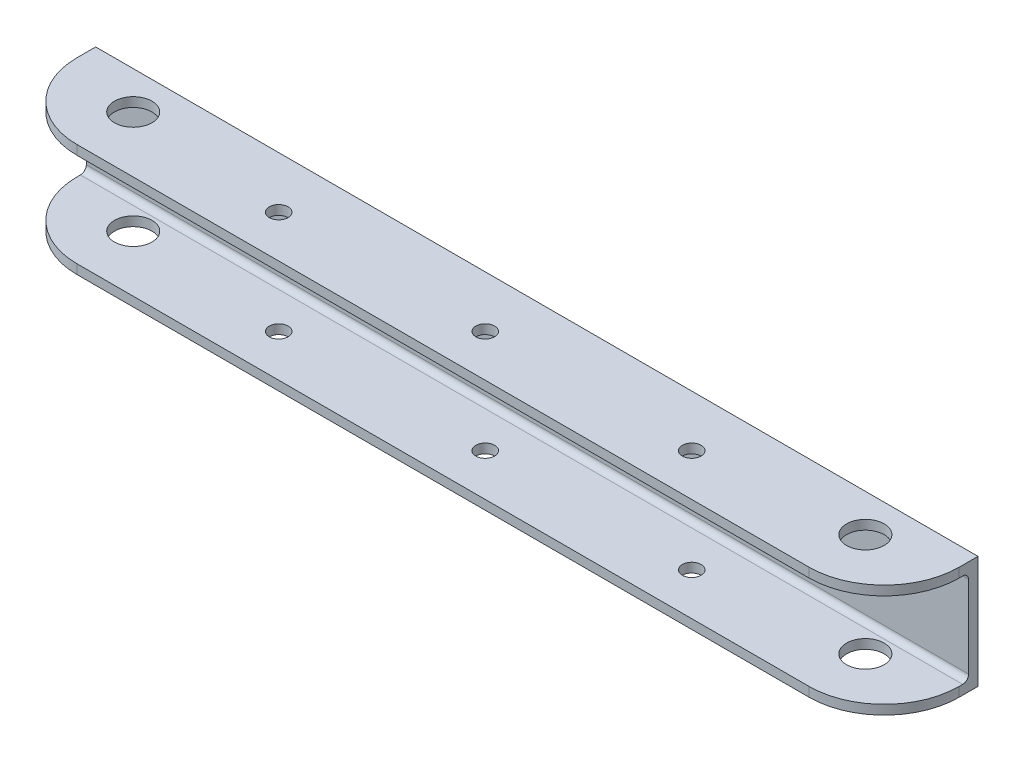
ISO-10303-21;
HEADER;
FILE_DESCRIPTION(('STEP AP214'),'2;1');
FILE_NAME('part.step','',(''),(''),'','','');
FILE_SCHEMA(('AUTOMOTIVE_DESIGN { 1 0 10303 214 1 1 1 1 }'));
ENDSEC;
DATA;
#1=APPLICATION_CONTEXT('core data for automotive mechanical design processes');
#2=APPLICATION_PROTOCOL_DEFINITION('international standard','automotive_design',2000,#1);
#3=PRODUCT_CONTEXT('',#1,'mechanical');
#4=PRODUCT('Part','Part','',(#3));
#5=PRODUCT_RELATED_PRODUCT_CATEGORY('part','',(#4));
#6=PRODUCT_DEFINITION_FORMATION('','',#4);
#7=PRODUCT_DEFINITION_CONTEXT('part definition',#1,'design');
#8=PRODUCT_DEFINITION('design','',#6,#7);
#9=PRODUCT_DEFINITION_SHAPE('','',#8);
#10=(LENGTH_UNIT() NAMED_UNIT(*) SI_UNIT(.MILLI.,.METRE.));
#11=(NAMED_UNIT(*) PLANE_ANGLE_UNIT() SI_UNIT($,.RADIAN.));
#12=(NAMED_UNIT(*) SI_UNIT($,.STERADIAN.) SOLID_ANGLE_UNIT());
#13=UNCERTAINTY_MEASURE_WITH_UNIT(LENGTH_MEASURE(1.E-05),#10,'distance_accuracy_value','');
#14=(GEOMETRIC_REPRESENTATION_CONTEXT(3) GLOBAL_UNCERTAINTY_ASSIGNED_CONTEXT((#13)) GLOBAL_UNIT_ASSIGNED_CONTEXT((#10,
#11,#12)) REPRESENTATION_CONTEXT('',''));
#15=CARTESIAN_POINT('',(0.,0.,0.));
#16=DIRECTION('',(0.,0.,1.));
#17=DIRECTION('',(1.,0.,0.));
#18=AXIS2_PLACEMENT_3D('',#15,#16,#17);
#19=CARTESIAN_POINT('',(0.,0.,31.75));
#20=DIRECTION('',(0.,0.,1.));
#21=DIRECTION('',(1.,0.,0.));
#22=AXIS2_PLACEMENT_3D('',#19,#20,#21);
#23=PLANE('',#22);
#24=DIRECTION('',(-1.,0.,0.));
#25=VECTOR('',#24,1.);
#26=CARTESIAN_POINT('',(0.,0.,31.75));
#27=LINE('',#26,#25);
#28=CARTESIAN_POINT('',(-313.675887252,0.,31.75));
#29=VERTEX_POINT('',#28);
#30=CARTESIAN_POINT('',(-561.325887252,0.,31.75));
#31=VERTEX_POINT('',#30);
#32=EDGE_CURVE('E190',#29,#31,#27,.T.);
#33=ORIENTED_EDGE('',*,*,#32,.F.);
#34=DIRECTION('',(0.,1.,0.));
#35=VECTOR('',#34,1.);
#36=CARTESIAN_POINT('',(-313.675887252,3.17499999999967,31.75));
#37=LINE('',#36,#35);
#38=CARTESIAN_POINT('',(-313.675887252,3.17499999999967,31.75));
#39=VERTEX_POINT('',#38);
#40=EDGE_CURVE('E236',#29,#39,#37,.T.);
#41=ORIENTED_EDGE('',*,*,#40,.T.);
#42=DIRECTION('',(-1.,0.,0.));
#43=VECTOR('',#42,1.);
#44=CARTESIAN_POINT('',(-288.275887252,3.17499999999967,31.75));
#45=LINE('',#44,#43);
#46=CARTESIAN_POINT('',(-561.325887252,3.17499999999967,31.75));
#47=VERTEX_POINT('',#46);
#48=EDGE_CURVE('E173',#39,#47,#45,.T.);
#49=ORIENTED_EDGE('',*,*,#48,.T.);
#50=DIRECTION('',(0.,1.,0.));
#51=VECTOR('',#50,1.);
#52=CARTESIAN_POINT('',(-561.325887252,4.90706239642227E-12,31.75));
#53=LINE('',#52,#51);
#54=EDGE_CURVE('E233',#47,#31,#53,.F.);
#55=ORIENTED_EDGE('',*,*,#54,.T.);
#56=EDGE_LOOP('',(#33,#41,#49,#55));
#57=FACE_BOUND('',#56,.T.);
#58=ADVANCED_FACE('F46',(#57),#23,.T.);
#59=CARTESIAN_POINT('',(-586.725887252,5.12910700134741E-12,31.75));
#60=DIRECTION('',(-1.,0.,0.));
#61=DIRECTION('',(0.,-1.,0.));
#62=AXIS2_PLACEMENT_3D('',#59,#60,#61);
#63=PLANE('',#62);
#64=DIRECTION('',(0.,0.,-1.));
#65=VECTOR('',#64,1.);
#66=CARTESIAN_POINT('',(-586.725887252,0.,31.75));
#67=LINE('',#66,#65);
#68=CARTESIAN_POINT('',(-586.725887252,0.,6.35));
#69=VERTEX_POINT('',#68);
#70=CARTESIAN_POINT('',(-586.725887252,0.,0.));
#71=VERTEX_POINT('',#70);
#72=EDGE_CURVE('E148',#69,#71,#67,.T.);
#73=ORIENTED_EDGE('',*,*,#72,.F.);
#74=DIRECTION('',(0.,1.,0.));
#75=VECTOR('',#74,1.);
#76=CARTESIAN_POINT('',(-586.725887252,5.12910700134741E-12,6.35));
#77=LINE('',#76,#75);
#78=CARTESIAN_POINT('',(-586.725887252,3.17499999999966,6.35000000000001));
#79=VERTEX_POINT('',#78);
#80=EDGE_CURVE('E254',#69,#79,#77,.T.);
#81=ORIENTED_EDGE('',*,*,#80,.T.);
#82=DIRECTION('',(0.,0.,1.));
#83=VECTOR('',#82,1.);
#84=CARTESIAN_POINT('',(-586.725887252,3.17499999999967,31.75));
#85=LINE('',#84,#83);
#86=CARTESIAN_POINT('',(-586.725887252,3.17499999999966,5.17500000000001));
#87=VERTEX_POINT('',#86);
#88=EDGE_CURVE('E330',#87,#79,#85,.T.);
#89=ORIENTED_EDGE('',*,*,#88,.F.);
#90=CARTESIAN_POINT('',(-586.725887252,5.17499999999966,5.175));
#91=DIRECTION('',(-1.,0.,0.));
#92=DIRECTION('',(0.,-1.,0.));
#93=AXIS2_PLACEMENT_3D('',#90,#91,#92);
#94=CIRCLE('',#93,2.);
#95=CARTESIAN_POINT('',(-586.725887252,5.17499999999966,3.175));
#96=VERTEX_POINT('',#95);
#97=EDGE_CURVE('E286',#87,#96,#94,.F.);
#98=ORIENTED_EDGE('',*,*,#97,.T.);
#99=DIRECTION('',(0.,-1.,0.));
#100=VECTOR('',#99,1.);
#101=CARTESIAN_POINT('',(-586.725887252,34.9249999999615,3.175));
#102=LINE('',#101,#100);
#103=CARTESIAN_POINT('',(-586.725887252,32.9249999999615,3.175));
#104=VERTEX_POINT('',#103);
#105=EDGE_CURVE('E325',#104,#96,#102,.T.);
#106=ORIENTED_EDGE('',*,*,#105,.F.);
#107=CARTESIAN_POINT('',(-586.725887252,32.9249999999615,5.175));
#108=DIRECTION('',(-1.,0.,0.));
#109=DIRECTION('',(0.,-1.,0.));
#110=AXIS2_PLACEMENT_3D('',#107,#108,#109);
#111=CIRCLE('',#110,2.);
#112=CARTESIAN_POINT('',(-586.725887252,34.9249999999615,5.175));
#113=VERTEX_POINT('',#112);
#114=EDGE_CURVE('E55',#104,#113,#111,.F.);
#115=ORIENTED_EDGE('',*,*,#114,.T.);
#116=DIRECTION('',(0.,0.,-1.));
#117=VECTOR('',#116,1.);
#118=CARTESIAN_POINT('',(-586.725887252,34.9249999999615,31.75));
#119=LINE('',#118,#117);
#120=CARTESIAN_POINT('',(-586.725887252,34.9249999999615,6.35));
#121=VERTEX_POINT('',#120);
#122=EDGE_CURVE('E323',#121,#113,#119,.T.);
#123=ORIENTED_EDGE('',*,*,#122,.F.);
#124=DIRECTION('',(0.,1.,0.));
#125=VECTOR('',#124,1.);
#126=CARTESIAN_POINT('',(-586.725887252,5.12910700134741E-12,6.35));
#127=LINE('',#126,#125);
#128=CARTESIAN_POINT('',(-586.725887252,38.0999999999806,6.35));
#129=VERTEX_POINT('',#128);
#130=EDGE_CURVE('E251',#121,#129,#127,.T.);
#131=ORIENTED_EDGE('',*,*,#130,.T.);
#132=DIRECTION('',(0.,0.,-1.));
#133=VECTOR('',#132,1.);
#134=CARTESIAN_POINT('',(-586.725887252,38.0999999999806,31.75));
#135=LINE('',#134,#133);
#136=CARTESIAN_POINT('',(-586.725887252,38.0999999999806,0.));
#137=VERTEX_POINT('',#136);
#138=EDGE_CURVE('E168',#129,#137,#135,.T.);
#139=ORIENTED_EDGE('',*,*,#138,.T.);
#140=DIRECTION('',(0.,1.,0.));
#141=VECTOR('',#140,1.);
#142=CARTESIAN_POINT('',(-586.725887252,5.12910700134741E-12,0.));
#143=LINE('',#142,#141);
#144=EDGE_CURVE('E164',#71,#137,#143,.T.);
#145=ORIENTED_EDGE('',*,*,#144,.F.);
#146=EDGE_LOOP('',(#73,#81,#89,#98,#106,#115,#123,#131,#139,#145));
#147=FACE_BOUND('',#146,.T.);
#148=ADVANCED_FACE('F165',(#147),#63,.T.);
#149=CARTESIAN_POINT('',(0.,0.,31.75));
#150=DIRECTION('',(0.,-1.,0.));
#151=DIRECTION('',(0.,0.,-1.));
#152=AXIS2_PLACEMENT_3D('',#149,#150,#151);
#153=PLANE('',#152);
#154=CARTESIAN_POINT('',(-507.350887252,0.,17.4625));
#155=DIRECTION('',(0.,-1.,0.));
#156=DIRECTION('',(0.,0.,-1.));
#157=AXIS2_PLACEMENT_3D('',#154,#155,#156);
#158=CIRCLE('',#157,3.17500000000008);
#159=CARTESIAN_POINT('',(-507.350887252,0.,14.2874999999999));
#160=VERTEX_POINT('',#159);
#161=EDGE_CURVE('E388',#160,#160,#158,.T.);
#162=ORIENTED_EDGE('',*,*,#161,.F.);
#163=EDGE_LOOP('',(#162));
#164=FACE_BOUND('',#163,.T.);
#165=CARTESIAN_POINT('',(-437.500887252,0.,17.4625));
#166=DIRECTION('',(0.,-1.,0.));
#167=DIRECTION('',(0.,0.,-1.));
#168=AXIS2_PLACEMENT_3D('',#165,#166,#167);
#169=CIRCLE('',#168,3.17499999999997);
#170=CARTESIAN_POINT('',(-437.500887252,0.,14.2875));
#171=VERTEX_POINT('',#170);
#172=EDGE_CURVE('E380',#171,#171,#169,.T.);
#173=ORIENTED_EDGE('',*,*,#172,.F.);
#174=EDGE_LOOP('',(#173));
#175=FACE_BOUND('',#174,.T.);
#176=CARTESIAN_POINT('',(-367.650887252,0.,17.4625));
#177=DIRECTION('',(0.,-1.,0.));
#178=DIRECTION('',(0.,0.,-1.));
#179=AXIS2_PLACEMENT_3D('',#176,#177,#178);
#180=CIRCLE('',#179,3.17499999999997);
#181=CARTESIAN_POINT('',(-367.650887252,0.,14.2875));
#182=VERTEX_POINT('',#181);
#183=EDGE_CURVE('E373',#182,#182,#180,.T.);
#184=ORIENTED_EDGE('',*,*,#183,.F.);
#185=EDGE_LOOP('',(#184));
#186=FACE_BOUND('',#185,.T.);
#187=CARTESIAN_POINT('',(-561.325887251953,0.,12.700000000014));
#188=DIRECTION('',(0.,-1.,0.));
#189=DIRECTION('',(0.,0.,-1.));
#190=AXIS2_PLACEMENT_3D('',#187,#188,#189);
#191=CIRCLE('',#190,6.3499999999972);
#192=CARTESIAN_POINT('',(-561.325887251953,0.,6.35000000001679));
#193=VERTEX_POINT('',#192);
#194=EDGE_CURVE('E360',#193,#193,#191,.T.);
#195=ORIENTED_EDGE('',*,*,#194,.F.);
#196=EDGE_LOOP('',(#195));
#197=FACE_BOUND('',#196,.T.);
#198=CARTESIAN_POINT('',(-313.675887252047,0.,12.700000000014));
#199=DIRECTION('',(0.,-1.,0.));
#200=DIRECTION('',(0.,0.,-1.));
#201=AXIS2_PLACEMENT_3D('',#198,#199,#200);
#202=CIRCLE('',#201,6.35);
#203=CARTESIAN_POINT('',(-313.675887252047,0.,6.35000000001399));
#204=VERTEX_POINT('',#203);
#205=EDGE_CURVE('E352',#204,#204,#202,.T.);
#206=ORIENTED_EDGE('',*,*,#205,.F.);
#207=EDGE_LOOP('',(#206));
#208=FACE_BOUND('',#207,.T.);
#209=DIRECTION('',(0.,0.,-1.));
#210=VECTOR('',#209,1.);
#211=CARTESIAN_POINT('',(-288.275887252,0.,31.75));
#212=LINE('',#211,#210);
#213=CARTESIAN_POINT('',(-288.275887252,0.,6.35));
#214=VERTEX_POINT('',#213);
#215=CARTESIAN_POINT('',(-288.275887252,0.,0.));
#216=VERTEX_POINT('',#215);
#217=EDGE_CURVE('E161',#214,#216,#212,.T.);
#218=ORIENTED_EDGE('',*,*,#217,.F.);
#219=CARTESIAN_POINT('',(-313.675887252,0.,6.35));
#220=DIRECTION('',(0.,-1.,0.));
#221=DIRECTION('',(0.,0.,-1.));
#222=AXIS2_PLACEMENT_3D('',#219,#220,#221);
#223=CIRCLE('',#222,25.4);
#224=EDGE_CURVE('E248',#214,#29,#223,.T.);
#225=ORIENTED_EDGE('',*,*,#224,.T.);
#226=ORIENTED_EDGE('',*,*,#32,.T.);
#227=CARTESIAN_POINT('',(-561.325887252,0.,6.35));
#228=DIRECTION('',(0.,-1.,0.));
#229=DIRECTION('',(0.,0.,-1.));
#230=AXIS2_PLACEMENT_3D('',#227,#228,#229);
#231=CIRCLE('',#230,25.4);
#232=EDGE_CURVE('E156',#31,#69,#231,.T.);
#233=ORIENTED_EDGE('',*,*,#232,.T.);
#234=ORIENTED_EDGE('',*,*,#72,.T.);
#235=DIRECTION('',(-1.,0.,0.));
#236=VECTOR('',#235,1.);
#237=CARTESIAN_POINT('',(0.,0.,0.));
#238=LINE('',#237,#236);
#239=EDGE_CURVE('E153',#216,#71,#238,.T.);
#240=ORIENTED_EDGE('',*,*,#239,.F.);
#241=EDGE_LOOP('',(#218,#225,#226,#233,#234,#240));
#242=FACE_BOUND('',#241,.T.);
#243=ADVANCED_FACE('F151',(#164,#175,#186,#197,#208,#242),#153,.T.);
#244=CARTESIAN_POINT('',(-288.275887252,0.,31.75));
#245=DIRECTION('',(-1.,0.,0.));
#246=DIRECTION('',(0.,0.,1.));
#247=AXIS2_PLACEMENT_3D('',#244,#245,#246);
#248=PLANE('',#247);
#249=DIRECTION('',(0.,0.,-1.));
#250=VECTOR('',#249,1.);
#251=CARTESIAN_POINT('',(-288.275887252,38.0999999999802,31.75));
#252=LINE('',#251,#250);
#253=CARTESIAN_POINT('',(-288.275887252,38.0999999999802,6.35));
#254=VERTEX_POINT('',#253);
#255=CARTESIAN_POINT('',(-288.275887252,38.0999999999802,0.));
#256=VERTEX_POINT('',#255);
#257=EDGE_CURVE('E193',#254,#256,#252,.T.);
#258=ORIENTED_EDGE('',*,*,#257,.F.);
#259=DIRECTION('',(0.,1.,0.));
#260=VECTOR('',#259,1.);
#261=CARTESIAN_POINT('',(-288.275887252,34.9249999999615,6.35));
#262=LINE('',#261,#260);
#263=CARTESIAN_POINT('',(-288.275887252,34.9249999999615,6.35));
#264=VERTEX_POINT('',#263);
#265=EDGE_CURVE('E224',#254,#264,#262,.F.);
#266=ORIENTED_EDGE('',*,*,#265,.T.);
#267=DIRECTION('',(0.,0.,-1.));
#268=VECTOR('',#267,1.);
#269=CARTESIAN_POINT('',(-288.275887252,34.9249999999615,31.75));
#270=LINE('',#269,#268);
#271=CARTESIAN_POINT('',(-288.275887252,34.9249999999615,5.175));
#272=VERTEX_POINT('',#271);
#273=EDGE_CURVE('E337',#264,#272,#270,.T.);
#274=ORIENTED_EDGE('',*,*,#273,.T.);
#275=CARTESIAN_POINT('',(-288.275887252,32.9249999999615,5.175));
#276=DIRECTION('',(-1.,0.,0.));
#277=DIRECTION('',(0.,0.,1.));
#278=AXIS2_PLACEMENT_3D('',#275,#276,#277);
#279=CIRCLE('',#278,2.);
#280=CARTESIAN_POINT('',(-288.275887252,32.9249999999615,3.175));
#281=VERTEX_POINT('',#280);
#282=EDGE_CURVE('E12',#272,#281,#279,.T.);
#283=ORIENTED_EDGE('',*,*,#282,.T.);
#284=DIRECTION('',(0.,-1.,0.));
#285=VECTOR('',#284,1.);
#286=CARTESIAN_POINT('',(-288.275887252,34.9249999999615,3.175));
#287=LINE('',#286,#285);
#288=CARTESIAN_POINT('',(-288.275887252,5.17499999999966,3.175));
#289=VERTEX_POINT('',#288);
#290=EDGE_CURVE('E298',#281,#289,#287,.T.);
#291=ORIENTED_EDGE('',*,*,#290,.T.);
#292=CARTESIAN_POINT('',(-288.275887252,5.17499999999966,5.175));
#293=DIRECTION('',(-1.,0.,0.));
#294=DIRECTION('',(0.,0.,1.));
#295=AXIS2_PLACEMENT_3D('',#292,#293,#294);
#296=CIRCLE('',#295,2.);
#297=CARTESIAN_POINT('',(-288.275887252,3.17499999999966,5.17500000000001));
#298=VERTEX_POINT('',#297);
#299=EDGE_CURVE('E289',#289,#298,#296,.T.);
#300=ORIENTED_EDGE('',*,*,#299,.T.);
#301=DIRECTION('',(0.,0.,1.));
#302=VECTOR('',#301,1.);
#303=CARTESIAN_POINT('',(-288.275887252,3.17499999999967,31.75));
#304=LINE('',#303,#302);
#305=CARTESIAN_POINT('',(-288.275887252,3.17499999999966,6.35000000000001));
#306=VERTEX_POINT('',#305);
#307=EDGE_CURVE('E296',#298,#306,#304,.T.);
#308=ORIENTED_EDGE('',*,*,#307,.T.);
#309=DIRECTION('',(0.,1.,0.));
#310=VECTOR('',#309,1.);
#311=CARTESIAN_POINT('',(-288.275887252,0.,6.35));
#312=LINE('',#311,#310);
#313=EDGE_CURVE('E221',#306,#214,#312,.F.);
#314=ORIENTED_EDGE('',*,*,#313,.T.);
#315=ORIENTED_EDGE('',*,*,#217,.T.);
#316=DIRECTION('',(0.,1.,0.));
#317=VECTOR('',#316,1.);
#318=CARTESIAN_POINT('',(-288.275887252,0.,0.));
#319=LINE('',#318,#317);
#320=EDGE_CURVE('E178',#216,#256,#319,.T.);
#321=ORIENTED_EDGE('',*,*,#320,.T.);
#322=EDGE_LOOP('',(#258,#266,#274,#283,#291,#300,#308,#314,#315,#321));
#323=FACE_BOUND('',#322,.T.);
#324=ADVANCED_FACE('F450',(#323),#248,.F.);
#325=CARTESIAN_POINT('',(1.82145964977459E-13,38.0999999999778,31.75));
#326=DIRECTION('',(0.,-1.,0.));
#327=DIRECTION('',(1.,0.,0.));
#328=AXIS2_PLACEMENT_3D('',#325,#326,#327);
#329=PLANE('',#328);
#330=CARTESIAN_POINT('',(-507.350887252,38.0999999999806,17.4625));
#331=DIRECTION('',(0.,-1.,0.));
#332=DIRECTION('',(0.,0.,-1.));
#333=AXIS2_PLACEMENT_3D('',#330,#331,#332);
#334=CIRCLE('',#333,3.17500000000008);
#335=CARTESIAN_POINT('',(-507.350887252,38.0999999999806,14.2874999999999));
#336=VERTEX_POINT('',#335);
#337=EDGE_CURVE('E263',#336,#336,#334,.T.);
#338=ORIENTED_EDGE('',*,*,#337,.T.);
#339=EDGE_LOOP('',(#338));
#340=FACE_BOUND('',#339,.T.);
#341=CARTESIAN_POINT('',(-437.500887252,38.0999999999806,17.4625));
#342=DIRECTION('',(0.,-1.,0.));
#343=DIRECTION('',(0.,0.,-1.));
#344=AXIS2_PLACEMENT_3D('',#341,#342,#343);
#345=CIRCLE('',#344,3.17499999999997);
#346=CARTESIAN_POINT('',(-437.500887252,38.0999999999806,14.2875));
#347=VERTEX_POINT('',#346);
#348=EDGE_CURVE('E384',#347,#347,#345,.T.);
#349=ORIENTED_EDGE('',*,*,#348,.T.);
#350=EDGE_LOOP('',(#349));
#351=FACE_BOUND('',#350,.T.);
#352=CARTESIAN_POINT('',(-367.650887252,38.0999999999806,17.4625));
#353=DIRECTION('',(0.,-1.,0.));
#354=DIRECTION('',(0.,0.,-1.));
#355=AXIS2_PLACEMENT_3D('',#352,#353,#354);
#356=CIRCLE('',#355,3.17499999999997);
#357=CARTESIAN_POINT('',(-367.650887252,38.0999999999806,14.2875));
#358=VERTEX_POINT('',#357);
#359=EDGE_CURVE('E377',#358,#358,#356,.T.);
#360=ORIENTED_EDGE('',*,*,#359,.T.);
#361=EDGE_LOOP('',(#360));
#362=FACE_BOUND('',#361,.T.);
#363=CARTESIAN_POINT('',(-561.325887251953,38.0999999999806,12.700000000014));
#364=DIRECTION('',(0.,-1.,0.));
#365=DIRECTION('',(0.,0.,-1.));
#366=AXIS2_PLACEMENT_3D('',#363,#364,#365);
#367=CIRCLE('',#366,6.3499999999972);
#368=CARTESIAN_POINT('',(-561.325887251953,38.0999999999806,6.35000000001679));
#369=VERTEX_POINT('',#368);
#370=EDGE_CURVE('E204',#369,#369,#367,.T.);
#371=ORIENTED_EDGE('',*,*,#370,.T.);
#372=EDGE_LOOP('',(#371));
#373=FACE_BOUND('',#372,.T.);
#374=CARTESIAN_POINT('',(-313.675887252047,38.0999999999806,12.700000000014));
#375=DIRECTION('',(0.,-1.,0.));
#376=DIRECTION('',(0.,0.,-1.));
#377=AXIS2_PLACEMENT_3D('',#374,#375,#376);
#378=CIRCLE('',#377,6.35);
#379=CARTESIAN_POINT('',(-313.675887252047,38.0999999999806,6.35000000001399));
#380=VERTEX_POINT('',#379);
#381=EDGE_CURVE('E356',#380,#380,#378,.T.);
#382=ORIENTED_EDGE('',*,*,#381,.T.);
#383=EDGE_LOOP('',(#382));
#384=FACE_BOUND('',#383,.T.);
#385=DIRECTION('',(-1.,0.,0.));
#386=VECTOR('',#385,1.);
#387=CARTESIAN_POINT('',(1.82145964977459E-13,38.0999999999778,31.75));
#388=LINE('',#387,#386);
#389=CARTESIAN_POINT('',(-313.675887252,38.0999999999793,31.75));
#390=VERTEX_POINT('',#389);
#391=CARTESIAN_POINT('',(-561.325887252,38.0999999999805,31.75));
#392=VERTEX_POINT('',#391);
#393=EDGE_CURVE('E194',#390,#392,#388,.T.);
#394=ORIENTED_EDGE('',*,*,#393,.F.);
#395=CARTESIAN_POINT('',(-313.675887252,38.0999999999793,6.35));
#396=DIRECTION('',(0.,-1.,0.));
#397=DIRECTION('',(1.,0.,0.));
#398=AXIS2_PLACEMENT_3D('',#395,#396,#397);
#399=CIRCLE('',#398,25.4);
#400=EDGE_CURVE('E218',#390,#254,#399,.F.);
#401=ORIENTED_EDGE('',*,*,#400,.T.);
#402=ORIENTED_EDGE('',*,*,#257,.T.);
#403=DIRECTION('',(-1.,0.,0.));
#404=VECTOR('',#403,1.);
#405=CARTESIAN_POINT('',(1.82145964977459E-13,38.0999999999778,0.));
#406=LINE('',#405,#404);
#407=EDGE_CURVE('E184',#256,#137,#406,.T.);
#408=ORIENTED_EDGE('',*,*,#407,.T.);
#409=ORIENTED_EDGE('',*,*,#138,.F.);
#410=CARTESIAN_POINT('',(-561.325887252,38.0999999999805,6.35));
#411=DIRECTION('',(0.,-1.,0.));
#412=DIRECTION('',(1.,0.,0.));
#413=AXIS2_PLACEMENT_3D('',#410,#411,#412);
#414=CIRCLE('',#413,25.4);
#415=EDGE_CURVE('E215',#129,#392,#414,.F.);
#416=ORIENTED_EDGE('',*,*,#415,.T.);
#417=EDGE_LOOP('',(#394,#401,#402,#408,#409,#416));
#418=FACE_BOUND('',#417,.T.);
#419=ADVANCED_FACE('F395',(#340,#351,#362,#373,#384,#418),#329,.F.);
#420=DIRECTION('',(-1.,0.,0.));
#421=VECTOR('',#420,1.);
#422=CARTESIAN_POINT('',(-288.275887252,34.9249999999615,31.75));
#423=LINE('',#422,#421);
#424=CARTESIAN_POINT('',(-313.675887252,34.9249999999615,31.75));
#425=VERTEX_POINT('',#424);
#426=CARTESIAN_POINT('',(-561.325887252,34.9249999999615,31.75));
#427=VERTEX_POINT('',#426);
#428=EDGE_CURVE('E297',#425,#427,#423,.T.);
#429=ORIENTED_EDGE('',*,*,#428,.F.);
#430=DIRECTION('',(0.,1.,0.));
#431=VECTOR('',#430,1.);
#432=CARTESIAN_POINT('',(-313.675887252,38.0999999999802,31.75));
#433=LINE('',#432,#431);
#434=EDGE_CURVE('E211',#425,#390,#433,.T.);
#435=ORIENTED_EDGE('',*,*,#434,.T.);
#436=ORIENTED_EDGE('',*,*,#393,.T.);
#437=DIRECTION('',(0.,1.,0.));
#438=VECTOR('',#437,1.);
#439=CARTESIAN_POINT('',(-561.325887252,4.90706239642227E-12,31.75));
#440=LINE('',#439,#438);
#441=EDGE_CURVE('E160',#392,#427,#440,.F.);
#442=ORIENTED_EDGE('',*,*,#441,.T.);
#443=EDGE_LOOP('',(#429,#435,#436,#442));
#444=FACE_BOUND('',#443,.T.);
#445=ADVANCED_FACE('F316',(#444),#23,.T.);
#446=CARTESIAN_POINT('',(0.,0.,0.));
#447=DIRECTION('',(0.,0.,1.));
#448=DIRECTION('',(1.,0.,0.));
#449=AXIS2_PLACEMENT_3D('',#446,#447,#448);
#450=PLANE('',#449);
#451=ORIENTED_EDGE('',*,*,#144,.T.);
#452=ORIENTED_EDGE('',*,*,#407,.F.);
#453=ORIENTED_EDGE('',*,*,#320,.F.);
#454=ORIENTED_EDGE('',*,*,#239,.T.);
#455=EDGE_LOOP('',(#451,#452,#453,#454));
#456=FACE_BOUND('',#455,.T.);
#457=ADVANCED_FACE('F176',(#456),#450,.F.);
#458=CARTESIAN_POINT('',(-288.275887252,3.17499999999967,31.75));
#459=DIRECTION('',(0.,-1.,0.));
#460=DIRECTION('',(0.,0.,-1.));
#461=AXIS2_PLACEMENT_3D('',#458,#459,#460);
#462=PLANE('',#461);
#463=CARTESIAN_POINT('',(-507.350887252,3.17499999999966,17.4625));
#464=DIRECTION('',(0.,-1.,0.));
#465=DIRECTION('',(0.,0.,-1.));
#466=AXIS2_PLACEMENT_3D('',#463,#464,#465);
#467=CIRCLE('',#466,3.17500000000008);
#468=CARTESIAN_POINT('',(-507.350887252,3.17499999999966,14.2874999999999));
#469=VERTEX_POINT('',#468);
#470=EDGE_CURVE('E273',#469,#469,#467,.T.);
#471=ORIENTED_EDGE('',*,*,#470,.T.);
#472=EDGE_LOOP('',(#471));
#473=FACE_BOUND('',#472,.T.);
#474=CARTESIAN_POINT('',(-437.500887252,3.17499999999966,17.4625));
#475=DIRECTION('',(0.,-1.,0.));
#476=DIRECTION('',(0.,0.,-1.));
#477=AXIS2_PLACEMENT_3D('',#474,#475,#476);
#478=CIRCLE('',#477,3.17499999999997);
#479=CARTESIAN_POINT('',(-437.500887252,3.17499999999966,14.2875));
#480=VERTEX_POINT('',#479);
#481=EDGE_CURVE('E268',#480,#480,#478,.T.);
#482=ORIENTED_EDGE('',*,*,#481,.T.);
#483=EDGE_LOOP('',(#482));
#484=FACE_BOUND('',#483,.T.);
#485=CARTESIAN_POINT('',(-367.650887252,3.17499999999966,17.4625));
#486=DIRECTION('',(0.,-1.,0.));
#487=DIRECTION('',(0.,0.,-1.));
#488=AXIS2_PLACEMENT_3D('',#485,#486,#487);
#489=CIRCLE('',#488,3.17499999999997);
#490=CARTESIAN_POINT('',(-367.650887252,3.17499999999966,14.2875));
#491=VERTEX_POINT('',#490);
#492=EDGE_CURVE('E262',#491,#491,#489,.T.);
#493=ORIENTED_EDGE('',*,*,#492,.T.);
#494=EDGE_LOOP('',(#493));
#495=FACE_BOUND('',#494,.T.);
#496=CARTESIAN_POINT('',(-561.325887251953,3.17499999999966,12.700000000014));
#497=DIRECTION('',(0.,-1.,0.));
#498=DIRECTION('',(0.,0.,-1.));
#499=AXIS2_PLACEMENT_3D('',#496,#497,#498);
#500=CIRCLE('',#499,6.3499999999972);
#501=CARTESIAN_POINT('',(-561.325887251953,3.17499999999966,6.35000000001679));
#502=VERTEX_POINT('',#501);
#503=EDGE_CURVE('E208',#502,#502,#500,.T.);
#504=ORIENTED_EDGE('',*,*,#503,.T.);
#505=EDGE_LOOP('',(#504));
#506=FACE_BOUND('',#505,.T.);
#507=CARTESIAN_POINT('',(-313.675887252047,3.17499999999966,12.700000000014));
#508=DIRECTION('',(0.,-1.,0.));
#509=DIRECTION('',(0.,0.,-1.));
#510=AXIS2_PLACEMENT_3D('',#507,#508,#509);
#511=CIRCLE('',#510,6.35);
#512=CARTESIAN_POINT('',(-313.675887252047,3.17499999999966,6.35000000001399));
#513=VERTEX_POINT('',#512);
#514=EDGE_CURVE('E203',#513,#513,#511,.T.);
#515=ORIENTED_EDGE('',*,*,#514,.T.);
#516=EDGE_LOOP('',(#515));
#517=FACE_BOUND('',#516,.T.);
#518=ORIENTED_EDGE('',*,*,#307,.F.);
#519=DIRECTION('',(-1.,0.,0.));
#520=VECTOR('',#519,1.);
#521=CARTESIAN_POINT('',(-586.725887252,3.17499999999966,5.175));
#522=LINE('',#521,#520);
#523=EDGE_CURVE('E257',#298,#87,#522,.T.);
#524=ORIENTED_EDGE('',*,*,#523,.T.);
#525=ORIENTED_EDGE('',*,*,#88,.T.);
#526=CARTESIAN_POINT('',(-561.325887252,3.17499999999966,6.35));
#527=DIRECTION('',(0.,-1.,0.));
#528=DIRECTION('',(0.,0.,-1.));
#529=AXIS2_PLACEMENT_3D('',#526,#527,#528);
#530=CIRCLE('',#529,25.4);
#531=EDGE_CURVE('E240',#79,#47,#530,.F.);
#532=ORIENTED_EDGE('',*,*,#531,.T.);
#533=ORIENTED_EDGE('',*,*,#48,.F.);
#534=CARTESIAN_POINT('',(-313.675887252,3.17499999999966,6.35));
#535=DIRECTION('',(0.,-1.,0.));
#536=DIRECTION('',(0.,0.,-1.));
#537=AXIS2_PLACEMENT_3D('',#534,#535,#536);
#538=CIRCLE('',#537,25.4);
#539=EDGE_CURVE('E242',#39,#306,#538,.F.);
#540=ORIENTED_EDGE('',*,*,#539,.T.);
#541=EDGE_LOOP('',(#518,#524,#525,#532,#533,#540));
#542=FACE_BOUND('',#541,.T.);
#543=ADVANCED_FACE('F449',(#473,#484,#495,#506,#517,#542),#462,.F.);
#544=CARTESIAN_POINT('',(-288.275887252,34.9249999999615,3.175));
#545=DIRECTION('',(0.,0.,-1.));
#546=DIRECTION('',(0.,1.,0.));
#547=AXIS2_PLACEMENT_3D('',#544,#545,#546);
#548=PLANE('',#547);
#549=ORIENTED_EDGE('',*,*,#105,.T.);
#550=DIRECTION('',(-1.,0.,0.));
#551=VECTOR('',#550,1.);
#552=CARTESIAN_POINT('',(-288.275887252,5.17499999999966,3.175));
#553=LINE('',#552,#551);
#554=EDGE_CURVE('E281',#96,#289,#553,.F.);
#555=ORIENTED_EDGE('',*,*,#554,.T.);
#556=ORIENTED_EDGE('',*,*,#290,.F.);
#557=DIRECTION('',(-1.,0.,0.));
#558=VECTOR('',#557,1.);
#559=CARTESIAN_POINT('',(-586.725887252,32.9249999999615,3.175));
#560=LINE('',#559,#558);
#561=EDGE_CURVE('E277',#281,#104,#560,.T.);
#562=ORIENTED_EDGE('',*,*,#561,.T.);
#563=EDGE_LOOP('',(#549,#555,#556,#562));
#564=FACE_BOUND('',#563,.T.);
#565=ADVANCED_FACE('F410',(#564),#548,.F.);
#566=CARTESIAN_POINT('',(-288.275887252,34.9249999999615,31.75));
#567=DIRECTION('',(0.,1.,0.));
#568=DIRECTION('',(0.,0.,1.));
#569=AXIS2_PLACEMENT_3D('',#566,#567,#568);
#570=PLANE('',#569);
#571=CARTESIAN_POINT('',(-507.350887252,34.9249999999615,17.4625));
#572=DIRECTION('',(0.,1.,0.));
#573=DIRECTION('',(0.,0.,1.));
#574=AXIS2_PLACEMENT_3D('',#571,#572,#573);
#575=CIRCLE('',#574,3.17500000000008);
#576=CARTESIAN_POINT('',(-507.350887252,34.9249999999615,20.6375000000001));
#577=VERTEX_POINT('',#576);
#578=EDGE_CURVE('E269',#577,#577,#575,.T.);
#579=ORIENTED_EDGE('',*,*,#578,.T.);
#580=EDGE_LOOP('',(#579));
#581=FACE_BOUND('',#580,.T.);
#582=CARTESIAN_POINT('',(-437.500887252,34.9249999999615,17.4625));
#583=DIRECTION('',(0.,1.,0.));
#584=DIRECTION('',(0.,0.,1.));
#585=AXIS2_PLACEMENT_3D('',#582,#583,#584);
#586=CIRCLE('',#585,3.17499999999997);
#587=CARTESIAN_POINT('',(-437.500887252,34.9249999999615,20.6375));
#588=VERTEX_POINT('',#587);
#589=EDGE_CURVE('E264',#588,#588,#586,.T.);
#590=ORIENTED_EDGE('',*,*,#589,.T.);
#591=EDGE_LOOP('',(#590));
#592=FACE_BOUND('',#591,.T.);
#593=CARTESIAN_POINT('',(-367.650887252,34.9249999999615,17.4625));
#594=DIRECTION('',(0.,1.,0.));
#595=DIRECTION('',(0.,0.,1.));
#596=AXIS2_PLACEMENT_3D('',#593,#594,#595);
#597=CIRCLE('',#596,3.17499999999997);
#598=CARTESIAN_POINT('',(-367.650887252,34.9249999999615,20.6375));
#599=VERTEX_POINT('',#598);
#600=EDGE_CURVE('E258',#599,#599,#597,.T.);
#601=ORIENTED_EDGE('',*,*,#600,.T.);
#602=EDGE_LOOP('',(#601));
#603=FACE_BOUND('',#602,.T.);
#604=CARTESIAN_POINT('',(-561.325887251953,34.9249999999615,12.700000000014));
#605=DIRECTION('',(0.,1.,0.));
#606=DIRECTION('',(0.,0.,1.));
#607=AXIS2_PLACEMENT_3D('',#604,#605,#606);
#608=CIRCLE('',#607,6.3499999999972);
#609=CARTESIAN_POINT('',(-561.325887251953,34.9249999999615,19.0500000000112));
#610=VERTEX_POINT('',#609);
#611=EDGE_CURVE('E205',#610,#610,#608,.T.);
#612=ORIENTED_EDGE('',*,*,#611,.T.);
#613=EDGE_LOOP('',(#612));
#614=FACE_BOUND('',#613,.T.);
#615=CARTESIAN_POINT('',(-313.675887252047,34.9249999999615,12.700000000014));
#616=DIRECTION('',(0.,1.,0.));
#617=DIRECTION('',(0.,0.,1.));
#618=AXIS2_PLACEMENT_3D('',#615,#616,#617);
#619=CIRCLE('',#618,6.35);
#620=CARTESIAN_POINT('',(-313.675887252047,34.9249999999615,19.050000000014));
#621=VERTEX_POINT('',#620);
#622=EDGE_CURVE('E199',#621,#621,#619,.T.);
#623=ORIENTED_EDGE('',*,*,#622,.T.);
#624=EDGE_LOOP('',(#623));
#625=FACE_BOUND('',#624,.T.);
#626=ORIENTED_EDGE('',*,*,#122,.T.);
#627=DIRECTION('',(-1.,0.,0.));
#628=VECTOR('',#627,1.);
#629=CARTESIAN_POINT('',(-288.275887252,34.9249999999615,5.175));
#630=LINE('',#629,#628);
#631=EDGE_CURVE('E68',#113,#272,#630,.F.);
#632=ORIENTED_EDGE('',*,*,#631,.T.);
#633=ORIENTED_EDGE('',*,*,#273,.F.);
#634=CARTESIAN_POINT('',(-313.675887252,34.9249999999615,6.35));
#635=DIRECTION('',(0.,1.,0.));
#636=DIRECTION('',(0.,0.,1.));
#637=AXIS2_PLACEMENT_3D('',#634,#635,#636);
#638=CIRCLE('',#637,25.4);
#639=EDGE_CURVE('E230',#264,#425,#638,.F.);
#640=ORIENTED_EDGE('',*,*,#639,.T.);
#641=ORIENTED_EDGE('',*,*,#428,.T.);
#642=CARTESIAN_POINT('',(-561.325887252,34.9249999999615,6.35));
#643=DIRECTION('',(0.,1.,0.));
#644=DIRECTION('',(0.,0.,1.));
#645=AXIS2_PLACEMENT_3D('',#642,#643,#644);
#646=CIRCLE('',#645,25.4);
#647=EDGE_CURVE('E227',#427,#121,#646,.F.);
#648=ORIENTED_EDGE('',*,*,#647,.T.);
#649=EDGE_LOOP('',(#626,#632,#633,#640,#641,#648));
#650=FACE_BOUND('',#649,.T.);
#651=ADVANCED_FACE('F322',(#581,#592,#603,#614,#625,#650),#570,.F.);
#652=CARTESIAN_POINT('',(-313.675887252047,38.0999999999806,12.700000000014));
#653=DIRECTION('',(0.,-1.,0.));
#654=DIRECTION('',(0.,0.,-1.));
#655=AXIS2_PLACEMENT_3D('',#652,#653,#654);
#656=CYLINDRICAL_SURFACE('',#655,6.35);
#657=ORIENTED_EDGE('',*,*,#381,.F.);
#658=EDGE_LOOP('',(#657));
#659=FACE_BOUND('',#658,.T.);
#660=ORIENTED_EDGE('',*,*,#622,.F.);
#661=EDGE_LOOP('',(#660));
#662=FACE_BOUND('',#661,.T.);
#663=ADVANCED_FACE('F409',(#659,#662),#656,.F.);
#664=CARTESIAN_POINT('',(-561.325887251953,38.0999999999806,12.700000000014));
#665=DIRECTION('',(0.,-1.,0.));
#666=DIRECTION('',(0.,0.,-1.));
#667=AXIS2_PLACEMENT_3D('',#664,#665,#666);
#668=CYLINDRICAL_SURFACE('',#667,6.3499999999972);
#669=ORIENTED_EDGE('',*,*,#370,.F.);
#670=EDGE_LOOP('',(#669));
#671=FACE_BOUND('',#670,.T.);
#672=ORIENTED_EDGE('',*,*,#611,.F.);
#673=EDGE_LOOP('',(#672));
#674=FACE_BOUND('',#673,.T.);
#675=ADVANCED_FACE('F421',(#671,#674),#668,.F.);
#676=ORIENTED_EDGE('',*,*,#205,.T.);
#677=EDGE_LOOP('',(#676));
#678=FACE_BOUND('',#677,.T.);
#679=ORIENTED_EDGE('',*,*,#514,.F.);
#680=EDGE_LOOP('',(#679));
#681=FACE_BOUND('',#680,.T.);
#682=ADVANCED_FACE('F424',(#678,#681),#656,.F.);
#683=ORIENTED_EDGE('',*,*,#194,.T.);
#684=EDGE_LOOP('',(#683));
#685=FACE_BOUND('',#684,.T.);
#686=ORIENTED_EDGE('',*,*,#503,.F.);
#687=EDGE_LOOP('',(#686));
#688=FACE_BOUND('',#687,.T.);
#689=ADVANCED_FACE('F430',(#685,#688),#668,.F.);
#690=CARTESIAN_POINT('',(-313.675887252,0.,6.35));
#691=DIRECTION('',(0.,-1.,0.));
#692=DIRECTION('',(0.,0.,-1.));
#693=AXIS2_PLACEMENT_3D('',#690,#691,#692);
#694=CYLINDRICAL_SURFACE('',#693,25.4);
#695=ORIENTED_EDGE('',*,*,#639,.F.);
#696=ORIENTED_EDGE('',*,*,#265,.F.);
#697=ORIENTED_EDGE('',*,*,#400,.F.);
#698=ORIENTED_EDGE('',*,*,#434,.F.);
#699=EDGE_LOOP('',(#695,#696,#697,#698));
#700=FACE_BOUND('',#699,.T.);
#701=ADVANCED_FACE('F460',(#700),#694,.T.);
#702=CARTESIAN_POINT('',(-313.675887252,0.,6.35));
#703=DIRECTION('',(0.,-1.,0.));
#704=DIRECTION('',(0.,0.,-1.));
#705=AXIS2_PLACEMENT_3D('',#702,#703,#704);
#706=CYLINDRICAL_SURFACE('',#705,25.4);
#707=ORIENTED_EDGE('',*,*,#224,.F.);
#708=ORIENTED_EDGE('',*,*,#313,.F.);
#709=ORIENTED_EDGE('',*,*,#539,.F.);
#710=ORIENTED_EDGE('',*,*,#40,.F.);
#711=EDGE_LOOP('',(#707,#708,#709,#710));
#712=FACE_BOUND('',#711,.T.);
#713=ADVANCED_FACE('F463',(#712),#706,.T.);
#714=CARTESIAN_POINT('',(-561.325887252,4.90706239642227E-12,6.35));
#715=DIRECTION('',(0.,1.,0.));
#716=DIRECTION('',(-1.,0.,0.));
#717=AXIS2_PLACEMENT_3D('',#714,#715,#716);
#718=CYLINDRICAL_SURFACE('',#717,25.4);
#719=ORIENTED_EDGE('',*,*,#232,.F.);
#720=ORIENTED_EDGE('',*,*,#54,.F.);
#721=ORIENTED_EDGE('',*,*,#531,.F.);
#722=ORIENTED_EDGE('',*,*,#80,.F.);
#723=EDGE_LOOP('',(#719,#720,#721,#722));
#724=FACE_BOUND('',#723,.T.);
#725=ADVANCED_FACE('F467',(#724),#718,.T.);
#726=CARTESIAN_POINT('',(-561.325887252,4.90706239642227E-12,6.35));
#727=DIRECTION('',(0.,1.,0.));
#728=DIRECTION('',(-1.,0.,0.));
#729=AXIS2_PLACEMENT_3D('',#726,#727,#728);
#730=CYLINDRICAL_SURFACE('',#729,25.4);
#731=ORIENTED_EDGE('',*,*,#647,.F.);
#732=ORIENTED_EDGE('',*,*,#441,.F.);
#733=ORIENTED_EDGE('',*,*,#415,.F.);
#734=ORIENTED_EDGE('',*,*,#130,.F.);
#735=EDGE_LOOP('',(#731,#732,#733,#734));
#736=FACE_BOUND('',#735,.T.);
#737=ADVANCED_FACE('F320',(#736),#730,.T.);
#738=CARTESIAN_POINT('',(-367.650887252,38.0999999999806,17.4625));
#739=DIRECTION('',(0.,-1.,0.));
#740=DIRECTION('',(0.,0.,-1.));
#741=AXIS2_PLACEMENT_3D('',#738,#739,#740);
#742=CYLINDRICAL_SURFACE('',#741,3.17499999999997);
#743=ORIENTED_EDGE('',*,*,#359,.F.);
#744=EDGE_LOOP('',(#743));
#745=FACE_BOUND('',#744,.T.);
#746=ORIENTED_EDGE('',*,*,#600,.F.);
#747=EDGE_LOOP('',(#746));
#748=FACE_BOUND('',#747,.T.);
#749=ADVANCED_FACE('F473',(#745,#748),#742,.F.);
#750=CARTESIAN_POINT('',(-437.500887252,38.0999999999806,17.4625));
#751=DIRECTION('',(0.,-1.,0.));
#752=DIRECTION('',(0.,0.,-1.));
#753=AXIS2_PLACEMENT_3D('',#750,#751,#752);
#754=CYLINDRICAL_SURFACE('',#753,3.17499999999997);
#755=ORIENTED_EDGE('',*,*,#348,.F.);
#756=EDGE_LOOP('',(#755));
#757=FACE_BOUND('',#756,.T.);
#758=ORIENTED_EDGE('',*,*,#589,.F.);
#759=EDGE_LOOP('',(#758));
#760=FACE_BOUND('',#759,.T.);
#761=ADVANCED_FACE('F402',(#757,#760),#754,.F.);
#762=CARTESIAN_POINT('',(-507.350887252,38.0999999999806,17.4625));
#763=DIRECTION('',(0.,-1.,0.));
#764=DIRECTION('',(0.,0.,-1.));
#765=AXIS2_PLACEMENT_3D('',#762,#763,#764);
#766=CYLINDRICAL_SURFACE('',#765,3.17500000000008);
#767=ORIENTED_EDGE('',*,*,#337,.F.);
#768=EDGE_LOOP('',(#767));
#769=FACE_BOUND('',#768,.T.);
#770=ORIENTED_EDGE('',*,*,#578,.F.);
#771=EDGE_LOOP('',(#770));
#772=FACE_BOUND('',#771,.T.);
#773=ADVANCED_FACE('F398',(#769,#772),#766,.F.);
#774=ORIENTED_EDGE('',*,*,#183,.T.);
#775=EDGE_LOOP('',(#774));
#776=FACE_BOUND('',#775,.T.);
#777=ORIENTED_EDGE('',*,*,#492,.F.);
#778=EDGE_LOOP('',(#777));
#779=FACE_BOUND('',#778,.T.);
#780=ADVANCED_FACE('F401',(#776,#779),#742,.F.);
#781=ORIENTED_EDGE('',*,*,#172,.T.);
#782=EDGE_LOOP('',(#781));
#783=FACE_BOUND('',#782,.T.);
#784=ORIENTED_EDGE('',*,*,#481,.F.);
#785=EDGE_LOOP('',(#784));
#786=FACE_BOUND('',#785,.T.);
#787=ADVANCED_FACE('F482',(#783,#786),#754,.F.);
#788=ORIENTED_EDGE('',*,*,#161,.T.);
#789=EDGE_LOOP('',(#788));
#790=FACE_BOUND('',#789,.T.);
#791=ORIENTED_EDGE('',*,*,#470,.F.);
#792=EDGE_LOOP('',(#791));
#793=FACE_BOUND('',#792,.T.);
#794=ADVANCED_FACE('F404',(#790,#793),#766,.F.);
#795=CARTESIAN_POINT('',(-288.275887252,5.17499999999966,5.175));
#796=DIRECTION('',(1.,0.,0.));
#797=DIRECTION('',(0.,0.,-1.));
#798=AXIS2_PLACEMENT_3D('',#795,#796,#797);
#799=CYLINDRICAL_SURFACE('',#798,2.);
#800=ORIENTED_EDGE('',*,*,#299,.F.);
#801=ORIENTED_EDGE('',*,*,#554,.F.);
#802=ORIENTED_EDGE('',*,*,#97,.F.);
#803=ORIENTED_EDGE('',*,*,#523,.F.);
#804=EDGE_LOOP('',(#800,#801,#802,#803));
#805=FACE_BOUND('',#804,.T.);
#806=ADVANCED_FACE('F474',(#805),#799,.F.);
#807=CARTESIAN_POINT('',(-288.275887252,32.9249999999615,5.175));
#808=DIRECTION('',(1.,0.,0.));
#809=DIRECTION('',(0.,0.,-1.));
#810=AXIS2_PLACEMENT_3D('',#807,#808,#809);
#811=CYLINDRICAL_SURFACE('',#810,2.);
#812=ORIENTED_EDGE('',*,*,#282,.F.);
#813=ORIENTED_EDGE('',*,*,#631,.F.);
#814=ORIENTED_EDGE('',*,*,#114,.F.);
#815=ORIENTED_EDGE('',*,*,#561,.F.);
#816=EDGE_LOOP('',(#812,#813,#814,#815));
#817=FACE_BOUND('',#816,.T.);
#818=ADVANCED_FACE('F48',(#817),#811,.F.);
#819=CLOSED_SHELL('',(#58,#148,#243,#324,#419,#445,#457,#543,#565,#651,#663,#675,#682,#689,#701,
#713,#725,#737,#749,#761,#773,#780,#787,#794,#806,#818));
#820=MANIFOLD_SOLID_BREP('B2',#819);
#821=ADVANCED_BREP_SHAPE_REPRESENTATION('',(#18,#820),#14);
#822=SHAPE_DEFINITION_REPRESENTATION(#9,#821);
ENDSEC;
END-ISO-10303-21;
